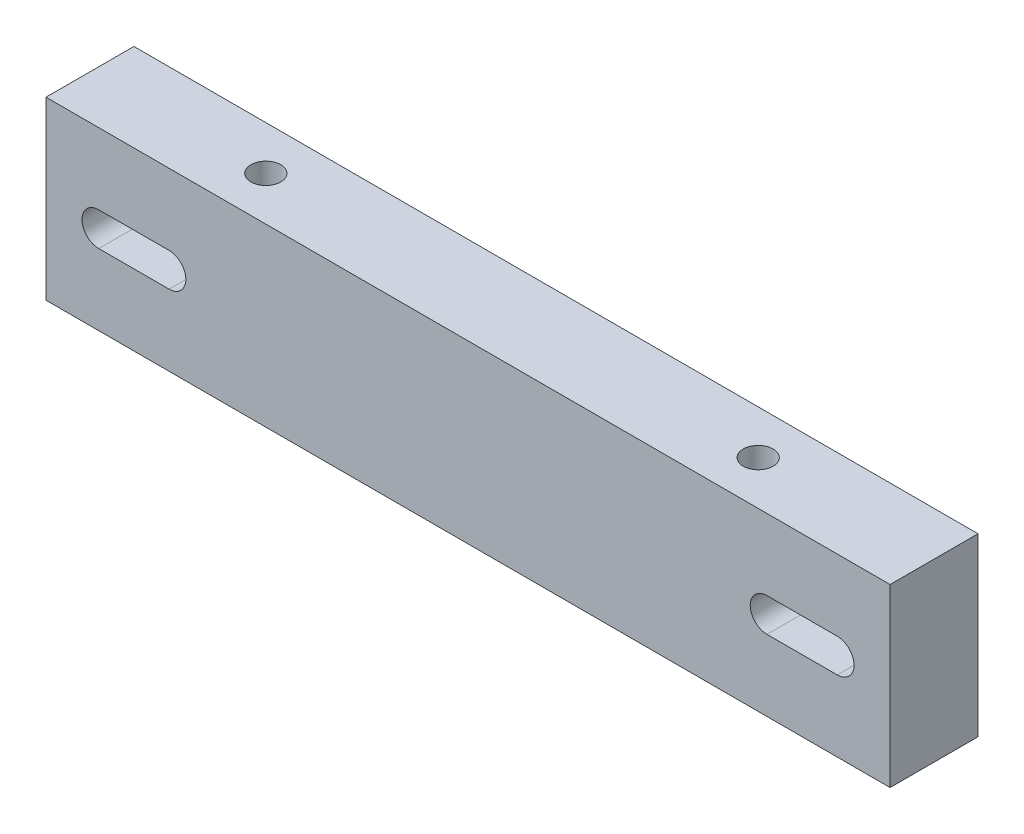
ISO-10303-21;
HEADER;
FILE_DESCRIPTION(('STEP AP214'),'2;1');
FILE_NAME('part.step','',(''),(''),'','','');
FILE_SCHEMA(('AUTOMOTIVE_DESIGN { 1 0 10303 214 1 1 1 1 }'));
ENDSEC;
DATA;
#1=APPLICATION_CONTEXT('core data for automotive mechanical design processes');
#2=APPLICATION_PROTOCOL_DEFINITION('international standard','automotive_design',2000,#1);
#3=PRODUCT_CONTEXT('',#1,'mechanical');
#4=PRODUCT('Part','Part','',(#3));
#5=PRODUCT_RELATED_PRODUCT_CATEGORY('part','',(#4));
#6=PRODUCT_DEFINITION_FORMATION('','',#4);
#7=PRODUCT_DEFINITION_CONTEXT('part definition',#1,'design');
#8=PRODUCT_DEFINITION('design','',#6,#7);
#9=PRODUCT_DEFINITION_SHAPE('','',#8);
#10=(LENGTH_UNIT() NAMED_UNIT(*) SI_UNIT(.MILLI.,.METRE.));
#11=(NAMED_UNIT(*) PLANE_ANGLE_UNIT() SI_UNIT($,.RADIAN.));
#12=(NAMED_UNIT(*) SI_UNIT($,.STERADIAN.) SOLID_ANGLE_UNIT());
#13=UNCERTAINTY_MEASURE_WITH_UNIT(LENGTH_MEASURE(1.E-05),#10,'distance_accuracy_value','');
#14=(GEOMETRIC_REPRESENTATION_CONTEXT(3) GLOBAL_UNCERTAINTY_ASSIGNED_CONTEXT((#13)) GLOBAL_UNIT_ASSIGNED_CONTEXT((#10,
#11,#12)) REPRESENTATION_CONTEXT('',''));
#15=CARTESIAN_POINT('',(0.,0.,0.));
#16=DIRECTION('',(0.,0.,1.));
#17=DIRECTION('',(1.,0.,0.));
#18=AXIS2_PLACEMENT_3D('',#15,#16,#17);
#19=CARTESIAN_POINT('',(-120.,-50.,-15.));
#20=DIRECTION('',(-1.,0.,0.));
#21=DIRECTION('',(0.,0.,1.));
#22=AXIS2_PLACEMENT_3D('',#19,#20,#21);
#23=PLANE('',#22);
#24=DIRECTION('',(0.,0.,1.));
#25=VECTOR('',#24,1.);
#26=CARTESIAN_POINT('',(-120.,0.,-15.));
#27=LINE('',#26,#25);
#28=CARTESIAN_POINT('',(-120.,0.,-15.));
#29=VERTEX_POINT('',#28);
#30=CARTESIAN_POINT('',(-120.,0.,9.99999999999999));
#31=VERTEX_POINT('',#30);
#32=EDGE_CURVE('E200',#29,#31,#27,.T.);
#33=ORIENTED_EDGE('',*,*,#32,.F.);
#34=DIRECTION('',(0.,1.,0.));
#35=VECTOR('',#34,1.);
#36=CARTESIAN_POINT('',(-120.,-50.,-15.));
#37=LINE('',#36,#35);
#38=CARTESIAN_POINT('',(-120.,-50.,-15.));
#39=VERTEX_POINT('',#38);
#40=EDGE_CURVE('E11',#39,#29,#37,.T.);
#41=ORIENTED_EDGE('',*,*,#40,.F.);
#42=DIRECTION('',(0.,0.,1.));
#43=VECTOR('',#42,1.);
#44=CARTESIAN_POINT('',(-120.,-50.,-15.));
#45=LINE('',#44,#43);
#46=CARTESIAN_POINT('',(-120.,-50.,9.99999999999999));
#47=VERTEX_POINT('',#46);
#48=EDGE_CURVE('E203',#39,#47,#45,.T.);
#49=ORIENTED_EDGE('',*,*,#48,.T.);
#50=DIRECTION('',(0.,1.,0.));
#51=VECTOR('',#50,1.);
#52=CARTESIAN_POINT('',(-120.,-50.,9.99999999999999));
#53=LINE('',#52,#51);
#54=EDGE_CURVE('E36',#47,#31,#53,.T.);
#55=ORIENTED_EDGE('',*,*,#54,.T.);
#56=EDGE_LOOP('',(#33,#41,#49,#55));
#57=FACE_BOUND('',#56,.T.);
#58=ADVANCED_FACE('F33',(#57),#23,.T.);
#59=CARTESIAN_POINT('',(-120.,-50.,-15.));
#60=DIRECTION('',(0.,0.,-1.));
#61=DIRECTION('',(-1.,0.,0.));
#62=AXIS2_PLACEMENT_3D('',#59,#60,#61);
#63=PLANE('',#62);
#64=CARTESIAN_POINT('',(85.,-25.,-15.));
#65=DIRECTION('',(0.,0.,1.));
#66=DIRECTION('',(1.,0.,0.));
#67=AXIS2_PLACEMENT_3D('',#64,#65,#66);
#68=CIRCLE('',#67,4.76747962750203);
#69=CARTESIAN_POINT('',(85.,-20.232520372498,-15.));
#70=VERTEX_POINT('',#69);
#71=CARTESIAN_POINT('',(85.,-29.767479627502,-15.));
#72=VERTEX_POINT('',#71);
#73=EDGE_CURVE('E124',#70,#72,#68,.T.);
#74=ORIENTED_EDGE('',*,*,#73,.T.);
#75=DIRECTION('',(1.,0.,0.));
#76=VECTOR('',#75,1.);
#77=CARTESIAN_POINT('',(85.,-29.767479627502,-15.));
#78=LINE('',#77,#76);
#79=CARTESIAN_POINT('',(105.,-29.767479627502,-15.));
#80=VERTEX_POINT('',#79);
#81=EDGE_CURVE('E133',#72,#80,#78,.T.);
#82=ORIENTED_EDGE('',*,*,#81,.T.);
#83=CARTESIAN_POINT('',(105.,-25.,-15.));
#84=DIRECTION('',(0.,0.,1.));
#85=DIRECTION('',(1.,0.,0.));
#86=AXIS2_PLACEMENT_3D('',#83,#84,#85);
#87=CIRCLE('',#86,4.76747962750204);
#88=CARTESIAN_POINT('',(105.,-20.232520372498,-15.));
#89=VERTEX_POINT('',#88);
#90=EDGE_CURVE('E49',#80,#89,#87,.T.);
#91=ORIENTED_EDGE('',*,*,#90,.T.);
#92=DIRECTION('',(-1.,0.,0.));
#93=VECTOR('',#92,1.);
#94=CARTESIAN_POINT('',(85.,-20.232520372498,-15.));
#95=LINE('',#94,#93);
#96=EDGE_CURVE('E130',#89,#70,#95,.T.);
#97=ORIENTED_EDGE('',*,*,#96,.T.);
#98=EDGE_LOOP('',(#74,#82,#91,#97));
#99=FACE_BOUND('',#98,.T.);
#100=CARTESIAN_POINT('',(-105.,-25.,-15.));
#101=DIRECTION('',(0.,0.,1.));
#102=DIRECTION('',(1.,0.,0.));
#103=AXIS2_PLACEMENT_3D('',#100,#101,#102);
#104=CIRCLE('',#103,4.76747962750203);
#105=CARTESIAN_POINT('',(-105.,-20.232520372498,-15.));
#106=VERTEX_POINT('',#105);
#107=CARTESIAN_POINT('',(-105.,-29.767479627502,-15.));
#108=VERTEX_POINT('',#107);
#109=EDGE_CURVE('E159',#106,#108,#104,.T.);
#110=ORIENTED_EDGE('',*,*,#109,.T.);
#111=DIRECTION('',(1.,0.,0.));
#112=VECTOR('',#111,1.);
#113=CARTESIAN_POINT('',(-105.,-29.767479627502,-15.));
#114=LINE('',#113,#112);
#115=CARTESIAN_POINT('',(-85.,-29.767479627502,-15.));
#116=VERTEX_POINT('',#115);
#117=EDGE_CURVE('E162',#108,#116,#114,.T.);
#118=ORIENTED_EDGE('',*,*,#117,.T.);
#119=CARTESIAN_POINT('',(-85.,-25.,-15.));
#120=DIRECTION('',(0.,0.,1.));
#121=DIRECTION('',(1.,0.,0.));
#122=AXIS2_PLACEMENT_3D('',#119,#120,#121);
#123=CIRCLE('',#122,4.76747962750204);
#124=CARTESIAN_POINT('',(-85.,-20.232520372498,-15.));
#125=VERTEX_POINT('',#124);
#126=EDGE_CURVE('E166',#116,#125,#123,.T.);
#127=ORIENTED_EDGE('',*,*,#126,.T.);
#128=DIRECTION('',(-1.,0.,0.));
#129=VECTOR('',#128,1.);
#130=CARTESIAN_POINT('',(-105.,-20.232520372498,-15.));
#131=LINE('',#130,#129);
#132=EDGE_CURVE('E169',#125,#106,#131,.T.);
#133=ORIENTED_EDGE('',*,*,#132,.T.);
#134=EDGE_LOOP('',(#110,#118,#127,#133));
#135=FACE_BOUND('',#134,.T.);
#136=DIRECTION('',(-1.,0.,0.));
#137=VECTOR('',#136,1.);
#138=CARTESIAN_POINT('',(-120.,0.,-15.));
#139=LINE('',#138,#137);
#140=CARTESIAN_POINT('',(120.,0.,-15.));
#141=VERTEX_POINT('',#140);
#142=EDGE_CURVE('E207',#141,#29,#139,.T.);
#143=ORIENTED_EDGE('',*,*,#142,.F.);
#144=DIRECTION('',(0.,1.,0.));
#145=VECTOR('',#144,1.);
#146=CARTESIAN_POINT('',(120.,-50.,-15.));
#147=LINE('',#146,#145);
#148=CARTESIAN_POINT('',(120.,-50.,-15.));
#149=VERTEX_POINT('',#148);
#150=EDGE_CURVE('E41',#149,#141,#147,.T.);
#151=ORIENTED_EDGE('',*,*,#150,.F.);
#152=DIRECTION('',(-1.,0.,0.));
#153=VECTOR('',#152,1.);
#154=CARTESIAN_POINT('',(-120.,-50.,-15.));
#155=LINE('',#154,#153);
#156=EDGE_CURVE('E213',#149,#39,#155,.T.);
#157=ORIENTED_EDGE('',*,*,#156,.T.);
#158=ORIENTED_EDGE('',*,*,#40,.T.);
#159=EDGE_LOOP('',(#143,#151,#157,#158));
#160=FACE_BOUND('',#159,.T.);
#161=ADVANCED_FACE('F137',(#99,#135,#160),#63,.T.);
#162=CARTESIAN_POINT('',(120.,-50.,-15.));
#163=DIRECTION('',(1.,0.,0.));
#164=DIRECTION('',(0.,0.,-1.));
#165=AXIS2_PLACEMENT_3D('',#162,#163,#164);
#166=PLANE('',#165);
#167=DIRECTION('',(0.,0.,-1.));
#168=VECTOR('',#167,1.);
#169=CARTESIAN_POINT('',(120.,0.,-15.));
#170=LINE('',#169,#168);
#171=CARTESIAN_POINT('',(120.,0.,9.99999999999999));
#172=VERTEX_POINT('',#171);
#173=EDGE_CURVE('E221',#172,#141,#170,.T.);
#174=ORIENTED_EDGE('',*,*,#173,.F.);
#175=DIRECTION('',(0.,1.,0.));
#176=VECTOR('',#175,1.);
#177=CARTESIAN_POINT('',(120.,-50.,9.99999999999999));
#178=LINE('',#177,#176);
#179=CARTESIAN_POINT('',(120.,-50.,9.99999999999999));
#180=VERTEX_POINT('',#179);
#181=EDGE_CURVE('E226',#180,#172,#178,.T.);
#182=ORIENTED_EDGE('',*,*,#181,.F.);
#183=DIRECTION('',(0.,0.,-1.));
#184=VECTOR('',#183,1.);
#185=CARTESIAN_POINT('',(120.,-50.,-15.));
#186=LINE('',#185,#184);
#187=EDGE_CURVE('E210',#180,#149,#186,.T.);
#188=ORIENTED_EDGE('',*,*,#187,.T.);
#189=ORIENTED_EDGE('',*,*,#150,.T.);
#190=EDGE_LOOP('',(#174,#182,#188,#189));
#191=FACE_BOUND('',#190,.T.);
#192=ADVANCED_FACE('F244',(#191),#166,.T.);
#193=CARTESIAN_POINT('',(-120.,-50.,9.99999999999999));
#194=DIRECTION('',(0.,0.,1.));
#195=DIRECTION('',(1.,0.,0.));
#196=AXIS2_PLACEMENT_3D('',#193,#194,#195);
#197=PLANE('',#196);
#198=CARTESIAN_POINT('',(85.,-25.,9.99999999999999));
#199=DIRECTION('',(0.,0.,1.));
#200=DIRECTION('',(1.,0.,0.));
#201=AXIS2_PLACEMENT_3D('',#198,#199,#200);
#202=CIRCLE('',#201,4.76747962750203);
#203=CARTESIAN_POINT('',(85.,-20.232520372498,9.99999999999999));
#204=VERTEX_POINT('',#203);
#205=CARTESIAN_POINT('',(85.,-29.767479627502,9.99999999999999));
#206=VERTEX_POINT('',#205);
#207=EDGE_CURVE('E57',#204,#206,#202,.T.);
#208=ORIENTED_EDGE('',*,*,#207,.F.);
#209=DIRECTION('',(-1.,0.,0.));
#210=VECTOR('',#209,1.);
#211=CARTESIAN_POINT('',(85.,-20.232520372498,9.99999999999999));
#212=LINE('',#211,#210);
#213=CARTESIAN_POINT('',(105.,-20.232520372498,9.99999999999999));
#214=VERTEX_POINT('',#213);
#215=EDGE_CURVE('E140',#214,#204,#212,.T.);
#216=ORIENTED_EDGE('',*,*,#215,.F.);
#217=CARTESIAN_POINT('',(105.,-25.,9.99999999999999));
#218=DIRECTION('',(0.,0.,1.));
#219=DIRECTION('',(1.,0.,0.));
#220=AXIS2_PLACEMENT_3D('',#217,#218,#219);
#221=CIRCLE('',#220,4.76747962750204);
#222=CARTESIAN_POINT('',(105.,-29.767479627502,9.99999999999999));
#223=VERTEX_POINT('',#222);
#224=EDGE_CURVE('E143',#223,#214,#221,.T.);
#225=ORIENTED_EDGE('',*,*,#224,.F.);
#226=DIRECTION('',(1.,0.,0.));
#227=VECTOR('',#226,1.);
#228=CARTESIAN_POINT('',(85.,-29.767479627502,9.99999999999999));
#229=LINE('',#228,#227);
#230=EDGE_CURVE('E149',#206,#223,#229,.T.);
#231=ORIENTED_EDGE('',*,*,#230,.F.);
#232=EDGE_LOOP('',(#208,#216,#225,#231));
#233=FACE_BOUND('',#232,.T.);
#234=CARTESIAN_POINT('',(-105.,-25.,9.99999999999999));
#235=DIRECTION('',(0.,0.,1.));
#236=DIRECTION('',(1.,0.,0.));
#237=AXIS2_PLACEMENT_3D('',#234,#235,#236);
#238=CIRCLE('',#237,4.76747962750203);
#239=CARTESIAN_POINT('',(-105.,-20.232520372498,9.99999999999999));
#240=VERTEX_POINT('',#239);
#241=CARTESIAN_POINT('',(-105.,-29.767479627502,9.99999999999999));
#242=VERTEX_POINT('',#241);
#243=EDGE_CURVE('E155',#240,#242,#238,.T.);
#244=ORIENTED_EDGE('',*,*,#243,.F.);
#245=DIRECTION('',(-1.,0.,0.));
#246=VECTOR('',#245,1.);
#247=CARTESIAN_POINT('',(-105.,-20.232520372498,9.99999999999999));
#248=LINE('',#247,#246);
#249=CARTESIAN_POINT('',(-85.,-20.232520372498,9.99999999999999));
#250=VERTEX_POINT('',#249);
#251=EDGE_CURVE('E163',#250,#240,#248,.T.);
#252=ORIENTED_EDGE('',*,*,#251,.F.);
#253=CARTESIAN_POINT('',(-85.,-25.,9.99999999999999));
#254=DIRECTION('',(0.,0.,1.));
#255=DIRECTION('',(1.,0.,0.));
#256=AXIS2_PLACEMENT_3D('',#253,#254,#255);
#257=CIRCLE('',#256,4.76747962750204);
#258=CARTESIAN_POINT('',(-85.,-29.767479627502,9.99999999999999));
#259=VERTEX_POINT('',#258);
#260=EDGE_CURVE('E177',#259,#250,#257,.T.);
#261=ORIENTED_EDGE('',*,*,#260,.F.);
#262=DIRECTION('',(1.,0.,0.));
#263=VECTOR('',#262,1.);
#264=CARTESIAN_POINT('',(-105.,-29.767479627502,9.99999999999999));
#265=LINE('',#264,#263);
#266=EDGE_CURVE('E174',#242,#259,#265,.T.);
#267=ORIENTED_EDGE('',*,*,#266,.F.);
#268=EDGE_LOOP('',(#244,#252,#261,#267));
#269=FACE_BOUND('',#268,.T.);
#270=DIRECTION('',(1.,0.,0.));
#271=VECTOR('',#270,1.);
#272=CARTESIAN_POINT('',(-120.,0.,9.99999999999999));
#273=LINE('',#272,#271);
#274=EDGE_CURVE('E218',#31,#172,#273,.T.);
#275=ORIENTED_EDGE('',*,*,#274,.F.);
#276=ORIENTED_EDGE('',*,*,#54,.F.);
#277=DIRECTION('',(1.,0.,0.));
#278=VECTOR('',#277,1.);
#279=CARTESIAN_POINT('',(-120.,-50.,9.99999999999999));
#280=LINE('',#279,#278);
#281=EDGE_CURVE('E206',#47,#180,#280,.T.);
#282=ORIENTED_EDGE('',*,*,#281,.T.);
#283=ORIENTED_EDGE('',*,*,#181,.T.);
#284=EDGE_LOOP('',(#275,#276,#282,#283));
#285=FACE_BOUND('',#284,.T.);
#286=ADVANCED_FACE('F234',(#233,#269,#285),#197,.T.);
#287=CARTESIAN_POINT('',(0.,-50.,0.));
#288=DIRECTION('',(0.,1.,0.));
#289=DIRECTION('',(0.,0.,1.));
#290=AXIS2_PLACEMENT_3D('',#287,#288,#289);
#291=PLANE('',#290);
#292=ORIENTED_EDGE('',*,*,#48,.F.);
#293=ORIENTED_EDGE('',*,*,#156,.F.);
#294=ORIENTED_EDGE('',*,*,#187,.F.);
#295=ORIENTED_EDGE('',*,*,#281,.F.);
#296=EDGE_LOOP('',(#292,#293,#294,#295));
#297=FACE_BOUND('',#296,.T.);
#298=ADVANCED_FACE('F241',(#297),#291,.F.);
#299=CARTESIAN_POINT('',(0.,0.,0.));
#300=DIRECTION('',(0.,1.,0.));
#301=DIRECTION('',(0.,0.,1.));
#302=AXIS2_PLACEMENT_3D('',#299,#300,#301);
#303=PLANE('',#302);
#304=CARTESIAN_POINT('',(70.,0.,-2.50000000000001));
#305=DIRECTION('',(0.,1.,0.));
#306=DIRECTION('',(0.,0.,1.));
#307=AXIS2_PLACEMENT_3D('',#304,#305,#306);
#308=CIRCLE('',#307,4.25000000000001);
#309=CARTESIAN_POINT('',(70.,0.,1.74999999999999));
#310=VERTEX_POINT('',#309);
#311=EDGE_CURVE('E184',#310,#310,#308,.T.);
#312=ORIENTED_EDGE('',*,*,#311,.F.);
#313=EDGE_LOOP('',(#312));
#314=FACE_BOUND('',#313,.T.);
#315=CARTESIAN_POINT('',(-70.,0.,-2.50000000000001));
#316=DIRECTION('',(0.,1.,0.));
#317=DIRECTION('',(0.,0.,1.));
#318=AXIS2_PLACEMENT_3D('',#315,#316,#317);
#319=CIRCLE('',#318,4.25000000000001);
#320=CARTESIAN_POINT('',(-70.,0.,1.74999999999999));
#321=VERTEX_POINT('',#320);
#322=EDGE_CURVE('E194',#321,#321,#319,.T.);
#323=ORIENTED_EDGE('',*,*,#322,.F.);
#324=EDGE_LOOP('',(#323));
#325=FACE_BOUND('',#324,.T.);
#326=ORIENTED_EDGE('',*,*,#32,.T.);
#327=ORIENTED_EDGE('',*,*,#274,.T.);
#328=ORIENTED_EDGE('',*,*,#173,.T.);
#329=ORIENTED_EDGE('',*,*,#142,.T.);
#330=EDGE_LOOP('',(#326,#327,#328,#329));
#331=FACE_BOUND('',#330,.T.);
#332=ADVANCED_FACE('F236',(#314,#325,#331),#303,.T.);
#333=CARTESIAN_POINT('',(-70.,-25.,-2.50000000000001));
#334=DIRECTION('',(0.,1.,0.));
#335=DIRECTION('',(0.,0.,1.));
#336=AXIS2_PLACEMENT_3D('',#333,#334,#335);
#337=CYLINDRICAL_SURFACE('',#336,4.25000000000001);
#338=CARTESIAN_POINT('',(-70.,-25.,-2.50000000000001));
#339=DIRECTION('',(0.,1.,0.));
#340=DIRECTION('',(0.,0.,1.));
#341=AXIS2_PLACEMENT_3D('',#338,#339,#340);
#342=CIRCLE('',#341,4.25000000000001);
#343=CARTESIAN_POINT('',(-70.,-25.,1.74999999999999));
#344=VERTEX_POINT('',#343);
#345=EDGE_CURVE('E197',#344,#344,#342,.T.);
#346=ORIENTED_EDGE('',*,*,#345,.F.);
#347=EDGE_LOOP('',(#346));
#348=FACE_BOUND('',#347,.T.);
#349=ORIENTED_EDGE('',*,*,#322,.T.);
#350=EDGE_LOOP('',(#349));
#351=FACE_BOUND('',#350,.T.);
#352=ADVANCED_FACE('F364',(#348,#351),#337,.F.);
#353=CARTESIAN_POINT('',(-70.,-25.,-2.50000000000001));
#354=DIRECTION('',(0.,1.,0.));
#355=DIRECTION('',(0.,0.,1.));
#356=AXIS2_PLACEMENT_3D('',#353,#354,#355);
#357=PLANE('',#356);
#358=ORIENTED_EDGE('',*,*,#345,.T.);
#359=EDGE_LOOP('',(#358));
#360=FACE_BOUND('',#359,.T.);
#361=ADVANCED_FACE('F360',(#360),#357,.T.);
#362=CARTESIAN_POINT('',(70.,-25.,-2.50000000000001));
#363=DIRECTION('',(0.,1.,0.));
#364=DIRECTION('',(0.,0.,1.));
#365=AXIS2_PLACEMENT_3D('',#362,#363,#364);
#366=CYLINDRICAL_SURFACE('',#365,4.25000000000001);
#367=CARTESIAN_POINT('',(70.,-25.,-2.50000000000001));
#368=DIRECTION('',(0.,1.,0.));
#369=DIRECTION('',(0.,0.,1.));
#370=AXIS2_PLACEMENT_3D('',#367,#368,#369);
#371=CIRCLE('',#370,4.25000000000001);
#372=CARTESIAN_POINT('',(70.,-25.,1.74999999999999));
#373=VERTEX_POINT('',#372);
#374=EDGE_CURVE('E191',#373,#373,#371,.T.);
#375=ORIENTED_EDGE('',*,*,#374,.F.);
#376=EDGE_LOOP('',(#375));
#377=FACE_BOUND('',#376,.T.);
#378=ORIENTED_EDGE('',*,*,#311,.T.);
#379=EDGE_LOOP('',(#378));
#380=FACE_BOUND('',#379,.T.);
#381=ADVANCED_FACE('F356',(#377,#380),#366,.F.);
#382=CARTESIAN_POINT('',(70.,-25.,-2.50000000000001));
#383=DIRECTION('',(0.,1.,0.));
#384=DIRECTION('',(0.,0.,1.));
#385=AXIS2_PLACEMENT_3D('',#382,#383,#384);
#386=PLANE('',#385);
#387=ORIENTED_EDGE('',*,*,#374,.T.);
#388=EDGE_LOOP('',(#387));
#389=FACE_BOUND('',#388,.T.);
#390=ADVANCED_FACE('F267',(#389),#386,.T.);
#391=CARTESIAN_POINT('',(-105.,-25.,-15.));
#392=DIRECTION('',(0.,0.,1.));
#393=DIRECTION('',(1.,0.,0.));
#394=AXIS2_PLACEMENT_3D('',#391,#392,#393);
#395=CYLINDRICAL_SURFACE('',#394,4.76747962750203);
#396=ORIENTED_EDGE('',*,*,#243,.T.);
#397=DIRECTION('',(0.,0.,1.));
#398=VECTOR('',#397,1.);
#399=CARTESIAN_POINT('',(-105.,-29.767479627502,-15.));
#400=LINE('',#399,#398);
#401=EDGE_CURVE('E172',#108,#242,#400,.T.);
#402=ORIENTED_EDGE('',*,*,#401,.F.);
#403=ORIENTED_EDGE('',*,*,#109,.F.);
#404=DIRECTION('',(0.,0.,1.));
#405=VECTOR('',#404,1.);
#406=CARTESIAN_POINT('',(-105.,-20.232520372498,-15.));
#407=LINE('',#406,#405);
#408=EDGE_CURVE('E182',#106,#240,#407,.T.);
#409=ORIENTED_EDGE('',*,*,#408,.T.);
#410=EDGE_LOOP('',(#396,#402,#403,#409));
#411=FACE_BOUND('',#410,.T.);
#412=ADVANCED_FACE('F280',(#411),#395,.F.);
#413=CARTESIAN_POINT('',(-105.,-20.232520372498,-15.));
#414=DIRECTION('',(0.,1.,0.));
#415=DIRECTION('',(-1.,0.,0.));
#416=AXIS2_PLACEMENT_3D('',#413,#414,#415);
#417=PLANE('',#416);
#418=ORIENTED_EDGE('',*,*,#251,.T.);
#419=ORIENTED_EDGE('',*,*,#408,.F.);
#420=ORIENTED_EDGE('',*,*,#132,.F.);
#421=DIRECTION('',(0.,0.,1.));
#422=VECTOR('',#421,1.);
#423=CARTESIAN_POINT('',(-85.,-20.232520372498,-15.));
#424=LINE('',#423,#422);
#425=EDGE_CURVE('E185',#125,#250,#424,.T.);
#426=ORIENTED_EDGE('',*,*,#425,.T.);
#427=EDGE_LOOP('',(#418,#419,#420,#426));
#428=FACE_BOUND('',#427,.T.);
#429=ADVANCED_FACE('F285',(#428),#417,.F.);
#430=CARTESIAN_POINT('',(-85.,-25.,-15.));
#431=DIRECTION('',(0.,0.,1.));
#432=DIRECTION('',(1.,0.,0.));
#433=AXIS2_PLACEMENT_3D('',#430,#431,#432);
#434=CYLINDRICAL_SURFACE('',#433,4.76747962750204);
#435=ORIENTED_EDGE('',*,*,#260,.T.);
#436=ORIENTED_EDGE('',*,*,#425,.F.);
#437=ORIENTED_EDGE('',*,*,#126,.F.);
#438=DIRECTION('',(0.,0.,1.));
#439=VECTOR('',#438,1.);
#440=CARTESIAN_POINT('',(-85.,-29.767479627502,-15.));
#441=LINE('',#440,#439);
#442=EDGE_CURVE('E187',#116,#259,#441,.T.);
#443=ORIENTED_EDGE('',*,*,#442,.T.);
#444=EDGE_LOOP('',(#435,#436,#437,#443));
#445=FACE_BOUND('',#444,.T.);
#446=ADVANCED_FACE('F295',(#445),#434,.F.);
#447=CARTESIAN_POINT('',(-105.,-29.767479627502,-15.));
#448=DIRECTION('',(0.,-1.,0.));
#449=DIRECTION('',(0.,0.,-1.));
#450=AXIS2_PLACEMENT_3D('',#447,#448,#449);
#451=PLANE('',#450);
#452=ORIENTED_EDGE('',*,*,#266,.T.);
#453=ORIENTED_EDGE('',*,*,#442,.F.);
#454=ORIENTED_EDGE('',*,*,#117,.F.);
#455=ORIENTED_EDGE('',*,*,#401,.T.);
#456=EDGE_LOOP('',(#452,#453,#454,#455));
#457=FACE_BOUND('',#456,.T.);
#458=ADVANCED_FACE('F305',(#457),#451,.F.);
#459=CARTESIAN_POINT('',(85.,-25.,-15.));
#460=DIRECTION('',(0.,0.,1.));
#461=DIRECTION('',(1.,0.,0.));
#462=AXIS2_PLACEMENT_3D('',#459,#460,#461);
#463=CYLINDRICAL_SURFACE('',#462,4.76747962750203);
#464=ORIENTED_EDGE('',*,*,#207,.T.);
#465=DIRECTION('',(0.,0.,1.));
#466=VECTOR('',#465,1.);
#467=CARTESIAN_POINT('',(85.,-29.767479627502,-15.));
#468=LINE('',#467,#466);
#469=EDGE_CURVE('E120',#72,#206,#468,.T.);
#470=ORIENTED_EDGE('',*,*,#469,.F.);
#471=ORIENTED_EDGE('',*,*,#73,.F.);
#472=DIRECTION('',(0.,0.,1.));
#473=VECTOR('',#472,1.);
#474=CARTESIAN_POINT('',(85.,-20.232520372498,-15.));
#475=LINE('',#474,#473);
#476=EDGE_CURVE('E153',#70,#204,#475,.T.);
#477=ORIENTED_EDGE('',*,*,#476,.T.);
#478=EDGE_LOOP('',(#464,#470,#471,#477));
#479=FACE_BOUND('',#478,.T.);
#480=ADVANCED_FACE('F122',(#479),#463,.F.);
#481=CARTESIAN_POINT('',(85.,-20.232520372498,-15.));
#482=DIRECTION('',(0.,1.,0.));
#483=DIRECTION('',(-1.,0.,0.));
#484=AXIS2_PLACEMENT_3D('',#481,#482,#483);
#485=PLANE('',#484);
#486=ORIENTED_EDGE('',*,*,#215,.T.);
#487=ORIENTED_EDGE('',*,*,#476,.F.);
#488=ORIENTED_EDGE('',*,*,#96,.F.);
#489=DIRECTION('',(0.,0.,1.));
#490=VECTOR('',#489,1.);
#491=CARTESIAN_POINT('',(105.,-20.232520372498,-15.));
#492=LINE('',#491,#490);
#493=EDGE_CURVE('E156',#89,#214,#492,.T.);
#494=ORIENTED_EDGE('',*,*,#493,.T.);
#495=EDGE_LOOP('',(#486,#487,#488,#494));
#496=FACE_BOUND('',#495,.T.);
#497=ADVANCED_FACE('F324',(#496),#485,.F.);
#498=CARTESIAN_POINT('',(105.,-25.,-15.));
#499=DIRECTION('',(0.,0.,1.));
#500=DIRECTION('',(1.,0.,0.));
#501=AXIS2_PLACEMENT_3D('',#498,#499,#500);
#502=CYLINDRICAL_SURFACE('',#501,4.76747962750204);
#503=ORIENTED_EDGE('',*,*,#224,.T.);
#504=ORIENTED_EDGE('',*,*,#493,.F.);
#505=ORIENTED_EDGE('',*,*,#90,.F.);
#506=DIRECTION('',(0.,0.,1.));
#507=VECTOR('',#506,1.);
#508=CARTESIAN_POINT('',(105.,-29.767479627502,-15.));
#509=LINE('',#508,#507);
#510=EDGE_CURVE('E129',#80,#223,#509,.T.);
#511=ORIENTED_EDGE('',*,*,#510,.T.);
#512=EDGE_LOOP('',(#503,#504,#505,#511));
#513=FACE_BOUND('',#512,.T.);
#514=ADVANCED_FACE('F333',(#513),#502,.F.);
#515=CARTESIAN_POINT('',(85.,-29.767479627502,-15.));
#516=DIRECTION('',(0.,-1.,0.));
#517=DIRECTION('',(1.,0.,0.));
#518=AXIS2_PLACEMENT_3D('',#515,#516,#517);
#519=PLANE('',#518);
#520=ORIENTED_EDGE('',*,*,#230,.T.);
#521=ORIENTED_EDGE('',*,*,#510,.F.);
#522=ORIENTED_EDGE('',*,*,#81,.F.);
#523=ORIENTED_EDGE('',*,*,#469,.T.);
#524=EDGE_LOOP('',(#520,#521,#522,#523));
#525=FACE_BOUND('',#524,.T.);
#526=ADVANCED_FACE('F134',(#525),#519,.F.);
#527=CLOSED_SHELL('',(#58,#161,#192,#286,#298,#332,#352,#361,#381,#390,#412,#429,#446,#458,#480,
#497,#514,#526));
#528=MANIFOLD_SOLID_BREP('B2',#527);
#529=ADVANCED_BREP_SHAPE_REPRESENTATION('',(#18,#528),#14);
#530=SHAPE_DEFINITION_REPRESENTATION(#9,#529);
ENDSEC;
END-ISO-10303-21;
